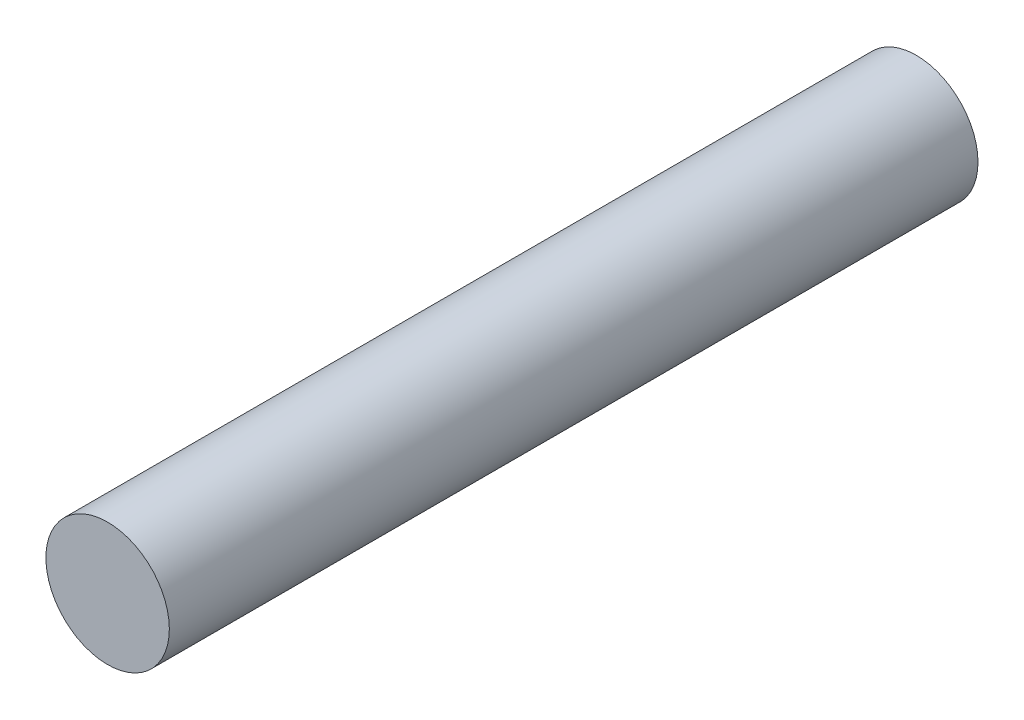
ISO-10303-21;
HEADER;
FILE_DESCRIPTION(('STEP AP214'),'2;1');
FILE_NAME('part.step','',(''),(''),'','','');
FILE_SCHEMA(('AUTOMOTIVE_DESIGN { 1 0 10303 214 1 1 1 1 }'));
ENDSEC;
DATA;
#1=APPLICATION_CONTEXT('core data for automotive mechanical design processes');
#2=APPLICATION_PROTOCOL_DEFINITION('international standard','automotive_design',2000,#1);
#3=PRODUCT_CONTEXT('',#1,'mechanical');
#4=PRODUCT('Part','Part','',(#3));
#5=PRODUCT_RELATED_PRODUCT_CATEGORY('part','',(#4));
#6=PRODUCT_DEFINITION_FORMATION('','',#4);
#7=PRODUCT_DEFINITION_CONTEXT('part definition',#1,'design');
#8=PRODUCT_DEFINITION('design','',#6,#7);
#9=PRODUCT_DEFINITION_SHAPE('','',#8);
#10=(LENGTH_UNIT() NAMED_UNIT(*) SI_UNIT(.MILLI.,.METRE.));
#11=(NAMED_UNIT(*) PLANE_ANGLE_UNIT() SI_UNIT($,.RADIAN.));
#12=(NAMED_UNIT(*) SI_UNIT($,.STERADIAN.) SOLID_ANGLE_UNIT());
#13=UNCERTAINTY_MEASURE_WITH_UNIT(LENGTH_MEASURE(1.E-05),#10,'distance_accuracy_value','');
#14=(GEOMETRIC_REPRESENTATION_CONTEXT(3) GLOBAL_UNCERTAINTY_ASSIGNED_CONTEXT((#13)) GLOBAL_UNIT_ASSIGNED_CONTEXT((#10,
#11,#12)) REPRESENTATION_CONTEXT('',''));
#15=CARTESIAN_POINT('',(0.,0.,0.));
#16=DIRECTION('',(0.,0.,1.));
#17=DIRECTION('',(1.,0.,0.));
#18=AXIS2_PLACEMENT_3D('',#15,#16,#17);
#19=CARTESIAN_POINT('',(0.,0.,131.));
#20=DIRECTION('',(0.,0.,-1.));
#21=DIRECTION('',(-1.,0.,0.));
#22=AXIS2_PLACEMENT_3D('',#19,#20,#21);
#23=CYLINDRICAL_SURFACE('',#22,10.);
#24=CARTESIAN_POINT('',(0.,0.,131.));
#25=DIRECTION('',(0.,0.,1.));
#26=DIRECTION('',(1.,0.,0.));
#27=AXIS2_PLACEMENT_3D('',#24,#25,#26);
#28=CIRCLE('',#27,10.);
#29=CARTESIAN_POINT('',(10.,0.,131.));
#30=VERTEX_POINT('',#29);
#31=EDGE_CURVE('E10',#30,#30,#28,.T.);
#32=ORIENTED_EDGE('',*,*,#31,.F.);
#33=EDGE_LOOP('',(#32));
#34=FACE_BOUND('',#33,.T.);
#35=CARTESIAN_POINT('',(0.,0.,0.));
#36=DIRECTION('',(0.,0.,1.));
#37=DIRECTION('',(1.,0.,0.));
#38=AXIS2_PLACEMENT_3D('',#35,#36,#37);
#39=CIRCLE('',#38,10.);
#40=CARTESIAN_POINT('',(10.,0.,0.));
#41=VERTEX_POINT('',#40);
#42=EDGE_CURVE('E37',#41,#41,#39,.T.);
#43=ORIENTED_EDGE('',*,*,#42,.T.);
#44=EDGE_LOOP('',(#43));
#45=FACE_BOUND('',#44,.T.);
#46=ADVANCED_FACE('F34',(#34,#45),#23,.T.);
#47=CARTESIAN_POINT('',(0.,0.,131.));
#48=DIRECTION('',(0.,0.,1.));
#49=DIRECTION('',(1.,0.,0.));
#50=AXIS2_PLACEMENT_3D('',#47,#48,#49);
#51=PLANE('',#50);
#52=ORIENTED_EDGE('',*,*,#31,.T.);
#53=EDGE_LOOP('',(#52));
#54=FACE_BOUND('',#53,.T.);
#55=ADVANCED_FACE('F49',(#54),#51,.T.);
#56=CARTESIAN_POINT('',(0.,0.,0.));
#57=DIRECTION('',(0.,0.,1.));
#58=DIRECTION('',(1.,0.,0.));
#59=AXIS2_PLACEMENT_3D('',#56,#57,#58);
#60=PLANE('',#59);
#61=ORIENTED_EDGE('',*,*,#42,.F.);
#62=EDGE_LOOP('',(#61));
#63=FACE_BOUND('',#62,.T.);
#64=ADVANCED_FACE('F47',(#63),#60,.F.);
#65=CLOSED_SHELL('',(#46,#55,#64));
#66=MANIFOLD_SOLID_BREP('B2',#65);
#67=ADVANCED_BREP_SHAPE_REPRESENTATION('',(#18,#66),#14);
#68=SHAPE_DEFINITION_REPRESENTATION(#9,#67);
ENDSEC;
END-ISO-10303-21;
